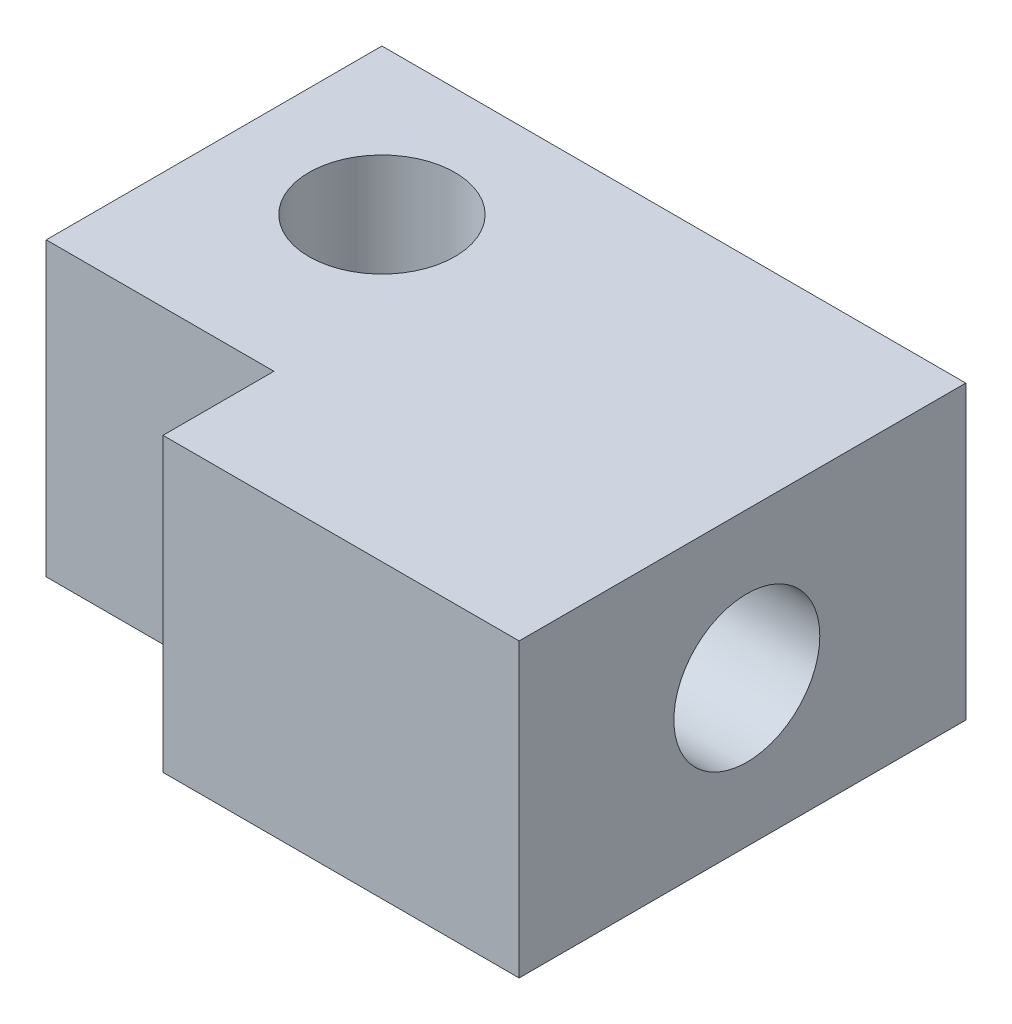
ISO-10303-21;
HEADER;
FILE_DESCRIPTION(('STEP AP214'),'2;1');
FILE_NAME('part.step','',(''),(''),'','','');
FILE_SCHEMA(('AUTOMOTIVE_DESIGN { 1 0 10303 214 1 1 1 1 }'));
ENDSEC;
DATA;
#1=APPLICATION_CONTEXT('core data for automotive mechanical design processes');
#2=APPLICATION_PROTOCOL_DEFINITION('international standard','automotive_design',2000,#1);
#3=PRODUCT_CONTEXT('',#1,'mechanical');
#4=PRODUCT('Part','Part','',(#3));
#5=PRODUCT_RELATED_PRODUCT_CATEGORY('part','',(#4));
#6=PRODUCT_DEFINITION_FORMATION('','',#4);
#7=PRODUCT_DEFINITION_CONTEXT('part definition',#1,'design');
#8=PRODUCT_DEFINITION('design','',#6,#7);
#9=PRODUCT_DEFINITION_SHAPE('','',#8);
#10=(LENGTH_UNIT() NAMED_UNIT(*) SI_UNIT(.MILLI.,.METRE.));
#11=(NAMED_UNIT(*) PLANE_ANGLE_UNIT() SI_UNIT($,.RADIAN.));
#12=(NAMED_UNIT(*) SI_UNIT($,.STERADIAN.) SOLID_ANGLE_UNIT());
#13=UNCERTAINTY_MEASURE_WITH_UNIT(LENGTH_MEASURE(1.E-05),#10,'distance_accuracy_value','');
#14=(GEOMETRIC_REPRESENTATION_CONTEXT(3) GLOBAL_UNCERTAINTY_ASSIGNED_CONTEXT((#13)) GLOBAL_UNIT_ASSIGNED_CONTEXT((#10,
#11,#12)) REPRESENTATION_CONTEXT('',''));
#15=CARTESIAN_POINT('',(0.,0.,0.));
#16=DIRECTION('',(0.,0.,1.));
#17=DIRECTION('',(1.,0.,0.));
#18=AXIS2_PLACEMENT_3D('',#15,#16,#17);
#19=CARTESIAN_POINT('',(79.,5.,0.));
#20=DIRECTION('',(1.,0.,0.));
#21=DIRECTION('',(0.,0.,-1.));
#22=AXIS2_PLACEMENT_3D('',#19,#20,#21);
#23=PLANE('',#22);
#24=CARTESIAN_POINT('',(79.,2.5,6.24999999999997));
#25=DIRECTION('',(1.,0.,0.));
#26=DIRECTION('',(0.,0.,-1.));
#27=AXIS2_PLACEMENT_3D('',#24,#25,#26);
#28=CIRCLE('',#27,1.25);
#29=CARTESIAN_POINT('',(79.,2.5,4.99999999999997));
#30=VERTEX_POINT('',#29);
#31=EDGE_CURVE('E184',#30,#30,#28,.T.);
#32=ORIENTED_EDGE('',*,*,#31,.T.);
#33=EDGE_LOOP('',(#32));
#34=FACE_BOUND('',#33,.T.);
#35=DIRECTION('',(0.,0.,1.));
#36=VECTOR('',#35,1.);
#37=CARTESIAN_POINT('',(79.,0.,0.));
#38=LINE('',#37,#36);
#39=CARTESIAN_POINT('',(79.,0.,2.49999999999997));
#40=VERTEX_POINT('',#39);
#41=CARTESIAN_POINT('',(79.,0.,8.24999999999999));
#42=VERTEX_POINT('',#41);
#43=EDGE_CURVE('E128',#40,#42,#38,.T.);
#44=ORIENTED_EDGE('',*,*,#43,.T.);
#45=DIRECTION('',(0.,-1.,0.));
#46=VECTOR('',#45,1.);
#47=CARTESIAN_POINT('',(79.,5.,8.24999999999999));
#48=LINE('',#47,#46);
#49=CARTESIAN_POINT('',(79.,5.,8.24999999999999));
#50=VERTEX_POINT('',#49);
#51=EDGE_CURVE('E11',#50,#42,#48,.T.);
#52=ORIENTED_EDGE('',*,*,#51,.F.);
#53=DIRECTION('',(0.,0.,1.));
#54=VECTOR('',#53,1.);
#55=CARTESIAN_POINT('',(79.,5.,0.));
#56=LINE('',#55,#54);
#57=CARTESIAN_POINT('',(79.,5.,2.49999999999997));
#58=VERTEX_POINT('',#57);
#59=EDGE_CURVE('E190',#58,#50,#56,.T.);
#60=ORIENTED_EDGE('',*,*,#59,.F.);
#61=DIRECTION('',(0.,-1.,0.));
#62=VECTOR('',#61,1.);
#63=CARTESIAN_POINT('',(79.,5.,2.49999999999997));
#64=LINE('',#63,#62);
#65=EDGE_CURVE('E57',#58,#40,#64,.T.);
#66=ORIENTED_EDGE('',*,*,#65,.T.);
#67=EDGE_LOOP('',(#44,#52,#60,#66));
#68=FACE_BOUND('',#67,.T.);
#69=ADVANCED_FACE('F34',(#34,#68),#23,.F.);
#70=CARTESIAN_POINT('',(0.,5.,8.24999999999999));
#71=DIRECTION('',(0.,0.,-1.));
#72=DIRECTION('',(-1.,0.,0.));
#73=AXIS2_PLACEMENT_3D('',#70,#71,#72);
#74=PLANE('',#73);
#75=DIRECTION('',(1.,0.,0.));
#76=VECTOR('',#75,1.);
#77=CARTESIAN_POINT('',(0.,0.,8.24999999999999));
#78=LINE('',#77,#76);
#79=CARTESIAN_POINT('',(82.9,0.,8.24999999999999));
#80=VERTEX_POINT('',#79);
#81=EDGE_CURVE('E130',#42,#80,#78,.T.);
#82=ORIENTED_EDGE('',*,*,#81,.T.);
#83=DIRECTION('',(0.,-1.,0.));
#84=VECTOR('',#83,1.);
#85=CARTESIAN_POINT('',(82.9,5.,8.24999999999999));
#86=LINE('',#85,#84);
#87=CARTESIAN_POINT('',(82.9,5.,8.24999999999999));
#88=VERTEX_POINT('',#87);
#89=EDGE_CURVE('E49',#88,#80,#86,.T.);
#90=ORIENTED_EDGE('',*,*,#89,.F.);
#91=DIRECTION('',(1.,0.,0.));
#92=VECTOR('',#91,1.);
#93=CARTESIAN_POINT('',(0.,5.,8.24999999999999));
#94=LINE('',#93,#92);
#95=EDGE_CURVE('E89',#50,#88,#94,.T.);
#96=ORIENTED_EDGE('',*,*,#95,.F.);
#97=ORIENTED_EDGE('',*,*,#51,.T.);
#98=EDGE_LOOP('',(#82,#90,#96,#97));
#99=FACE_BOUND('',#98,.T.);
#100=ADVANCED_FACE('F149',(#99),#74,.F.);
#101=CARTESIAN_POINT('',(82.9,5.,0.));
#102=DIRECTION('',(-1.,0.,0.));
#103=DIRECTION('',(0.,0.,1.));
#104=AXIS2_PLACEMENT_3D('',#101,#102,#103);
#105=PLANE('',#104);
#106=DIRECTION('',(0.,0.,-1.));
#107=VECTOR('',#106,1.);
#108=CARTESIAN_POINT('',(82.9,0.,0.));
#109=LINE('',#108,#107);
#110=CARTESIAN_POINT('',(82.9,0.,10.15));
#111=VERTEX_POINT('',#110);
#112=EDGE_CURVE('E133',#111,#80,#109,.T.);
#113=ORIENTED_EDGE('',*,*,#112,.F.);
#114=DIRECTION('',(0.,-1.,0.));
#115=VECTOR('',#114,1.);
#116=CARTESIAN_POINT('',(82.9,5.,10.15));
#117=LINE('',#116,#115);
#118=CARTESIAN_POINT('',(82.9,5.,10.15));
#119=VERTEX_POINT('',#118);
#120=EDGE_CURVE('E117',#119,#111,#117,.T.);
#121=ORIENTED_EDGE('',*,*,#120,.F.);
#122=DIRECTION('',(0.,0.,-1.));
#123=VECTOR('',#122,1.);
#124=CARTESIAN_POINT('',(82.9,5.,0.));
#125=LINE('',#124,#123);
#126=EDGE_CURVE('E107',#119,#88,#125,.T.);
#127=ORIENTED_EDGE('',*,*,#126,.T.);
#128=ORIENTED_EDGE('',*,*,#89,.T.);
#129=EDGE_LOOP('',(#113,#121,#127,#128));
#130=FACE_BOUND('',#129,.T.);
#131=ADVANCED_FACE('F148',(#130),#105,.T.);
#132=CARTESIAN_POINT('',(0.,5.,10.15));
#133=DIRECTION('',(0.,0.,-1.));
#134=DIRECTION('',(-1.,0.,0.));
#135=AXIS2_PLACEMENT_3D('',#132,#133,#134);
#136=PLANE('',#135);
#137=DIRECTION('',(1.,0.,0.));
#138=VECTOR('',#137,1.);
#139=CARTESIAN_POINT('',(0.,0.,10.15));
#140=LINE('',#139,#138);
#141=CARTESIAN_POINT('',(89.,0.,10.15));
#142=VERTEX_POINT('',#141);
#143=EDGE_CURVE('E114',#111,#142,#140,.T.);
#144=ORIENTED_EDGE('',*,*,#143,.T.);
#145=DIRECTION('',(0.,-1.,0.));
#146=VECTOR('',#145,1.);
#147=CARTESIAN_POINT('',(89.,5.,10.15));
#148=LINE('',#147,#146);
#149=CARTESIAN_POINT('',(89.,5.,10.15));
#150=VERTEX_POINT('',#149);
#151=EDGE_CURVE('E111',#150,#142,#148,.T.);
#152=ORIENTED_EDGE('',*,*,#151,.F.);
#153=DIRECTION('',(1.,0.,0.));
#154=VECTOR('',#153,1.);
#155=CARTESIAN_POINT('',(0.,5.,10.15));
#156=LINE('',#155,#154);
#157=EDGE_CURVE('E100',#119,#150,#156,.T.);
#158=ORIENTED_EDGE('',*,*,#157,.F.);
#159=ORIENTED_EDGE('',*,*,#120,.T.);
#160=EDGE_LOOP('',(#144,#152,#158,#159));
#161=FACE_BOUND('',#160,.T.);
#162=ADVANCED_FACE('F112',(#161),#136,.F.);
#163=CARTESIAN_POINT('',(89.,5.,0.));
#164=DIRECTION('',(1.,0.,0.));
#165=DIRECTION('',(0.,0.,-1.));
#166=AXIS2_PLACEMENT_3D('',#163,#164,#165);
#167=PLANE('',#166);
#168=CARTESIAN_POINT('',(89.,2.5,6.24999999999997));
#169=DIRECTION('',(1.,0.,0.));
#170=DIRECTION('',(0.,0.,-1.));
#171=AXIS2_PLACEMENT_3D('',#168,#169,#170);
#172=CIRCLE('',#171,1.25);
#173=CARTESIAN_POINT('',(89.,2.5,4.99999999999997));
#174=VERTEX_POINT('',#173);
#175=EDGE_CURVE('E182',#174,#174,#172,.T.);
#176=ORIENTED_EDGE('',*,*,#175,.F.);
#177=EDGE_LOOP('',(#176));
#178=FACE_BOUND('',#177,.T.);
#179=DIRECTION('',(0.,0.,1.));
#180=VECTOR('',#179,1.);
#181=CARTESIAN_POINT('',(89.,0.,0.));
#182=LINE('',#181,#180);
#183=CARTESIAN_POINT('',(89.,0.,2.49999999999997));
#184=VERTEX_POINT('',#183);
#185=EDGE_CURVE('E137',#184,#142,#182,.T.);
#186=ORIENTED_EDGE('',*,*,#185,.F.);
#187=DIRECTION('',(0.,-1.,0.));
#188=VECTOR('',#187,1.);
#189=CARTESIAN_POINT('',(89.,5.,2.49999999999997));
#190=LINE('',#189,#188);
#191=CARTESIAN_POINT('',(89.,5.,2.49999999999997));
#192=VERTEX_POINT('',#191);
#193=EDGE_CURVE('E77',#192,#184,#190,.T.);
#194=ORIENTED_EDGE('',*,*,#193,.F.);
#195=DIRECTION('',(0.,0.,1.));
#196=VECTOR('',#195,1.);
#197=CARTESIAN_POINT('',(89.,5.,0.));
#198=LINE('',#197,#196);
#199=EDGE_CURVE('E105',#192,#150,#198,.T.);
#200=ORIENTED_EDGE('',*,*,#199,.T.);
#201=ORIENTED_EDGE('',*,*,#151,.T.);
#202=EDGE_LOOP('',(#186,#194,#200,#201));
#203=FACE_BOUND('',#202,.T.);
#204=ADVANCED_FACE('F119',(#178,#203),#167,.T.);
#205=CARTESIAN_POINT('',(81.5,5.,5.));
#206=DIRECTION('',(0.,-1.,0.));
#207=DIRECTION('',(0.,0.,-1.));
#208=AXIS2_PLACEMENT_3D('',#205,#206,#207);
#209=CYLINDRICAL_SURFACE('',#208,1.25);
#210=CARTESIAN_POINT('',(80.25,2.5,4.99999999999997));
#211=CARTESIAN_POINT('',(80.2499966441939,2.56961208202377,5.00000213470243));
#212=CARTESIAN_POINT('',(80.2499582988169,2.63924791062334,5.00583137700037));
#213=CARTESIAN_POINT('',(80.2502843717335,2.77662237854133,5.0290008984842));
#214=CARTESIAN_POINT('',(80.2506491083581,2.84435947500368,5.04635027128573));
#215=CARTESIAN_POINT('',(80.2531877682139,2.97606907888645,5.09210426216157));
#216=CARTESIAN_POINT('',(80.2553639583087,3.04003676178567,5.12052270841945));
#217=CARTESIAN_POINT('',(80.2636853395395,3.16215940293159,5.18750913779315));
#218=CARTESIAN_POINT('',(80.2698290795568,3.2203164774131,5.22607340705217));
#219=CARTESIAN_POINT('',(80.2883337207344,3.32668681324461,5.31005580178865));
#220=CARTESIAN_POINT('',(80.3004411549752,3.37520075741395,5.35514553441002));
#221=CARTESIAN_POINT('',(80.3330033337281,3.4632495864012,5.45071740351099));
#222=CARTESIAN_POINT('',(80.3534443376478,3.50279908578408,5.50119056299411));
#223=CARTESIAN_POINT('',(80.4006584215015,3.56721932561987,5.59699246732916));
#224=CARTESIAN_POINT('',(80.4261912733856,3.5933551955091,5.64208658692434));
#225=CARTESIAN_POINT('',(80.4846953353207,3.63829483438518,5.73108683186754));
#226=CARTESIAN_POINT('',(80.5176667460866,3.6570984054871,5.77499292512322));
#227=CARTESIAN_POINT('',(80.5883287029856,3.68730487831171,5.8568025573928));
#228=CARTESIAN_POINT('',(80.6256353069815,3.69907334581835,5.89490647139188));
#229=CARTESIAN_POINT('',(80.7054728944305,3.71798823476215,5.96649089793395));
#230=CARTESIAN_POINT('',(80.748005582285,3.72513314351534,5.99996989453367));
#231=CARTESIAN_POINT('',(80.8417661902864,3.73660714807492,6.06431813490495));
#232=CARTESIAN_POINT('',(80.8934380713187,3.74058751648074,6.09460102816854));
#233=CARTESIAN_POINT('',(81.0006895768752,3.74607520609984,6.1475065401068));
#234=CARTESIAN_POINT('',(81.0562713048303,3.74758118535783,6.17012499679175));
#235=CARTESIAN_POINT('',(81.1772527978942,3.74951998206867,6.20949049954831));
#236=CARTESIAN_POINT('',(81.2430113293509,3.74979511490995,6.2251501386427));
#237=CARTESIAN_POINT('',(81.376191775167,3.75003468571998,6.24567841175893));
#238=CARTESIAN_POINT('',(81.4436139719799,3.74999907056363,6.25054520046926));
#239=CARTESIAN_POINT('',(81.5811605820418,3.75000096595674,6.24933355657024));
#240=CARTESIAN_POINT('',(81.6512814610072,3.75004156090999,6.24279425347822));
#241=CARTESIAN_POINT('',(81.7894585600108,3.74965176666125,6.2180487393185));
#242=CARTESIAN_POINT('',(81.8575139843125,3.74922119824797,6.1998380900396));
#243=CARTESIAN_POINT('',(81.989648093395,3.7463993537575,6.15224958180106));
#244=CARTESIAN_POINT('',(82.0537230174764,3.74400625293701,6.12286134367093));
#245=CARTESIAN_POINT('',(82.1758267664104,3.73500655620218,6.05388102424775));
#246=CARTESIAN_POINT('',(82.233857988606,3.72840163844329,6.01429301069332));
#247=CARTESIAN_POINT('',(82.3391241034773,3.70878882707751,5.9288332669613));
#248=CARTESIAN_POINT('',(82.3867536693946,3.69611750236942,5.88337455897488));
#249=CARTESIAN_POINT('',(82.4729905664969,3.66233911820245,5.78735924012225));
#250=CARTESIAN_POINT('',(82.5116126032548,3.64124596301134,5.73681113410658));
#251=CARTESIAN_POINT('',(82.5743051627702,3.59287212678173,5.64123603257127));
#252=CARTESIAN_POINT('',(82.5996459406913,3.56683986489073,5.59640475030392));
#253=CARTESIAN_POINT('',(82.6431233587973,3.50744619431329,5.50812495478607));
#254=CARTESIAN_POINT('',(82.6612594338449,3.47408421100177,5.46467655025436));
#255=CARTESIAN_POINT('',(82.6904318695824,3.40255553597077,5.38358776850986));
#256=CARTESIAN_POINT('',(82.7017839204193,3.36472187446476,5.34576398844717));
#257=CARTESIAN_POINT('',(82.7199571995565,3.28389364826441,5.27485662987009));
#258=CARTESIAN_POINT('',(82.7267769247775,3.24089737704215,5.24177462674631));
#259=CARTESIAN_POINT('',(82.737694336363,3.14603902502818,5.17821603954547));
#260=CARTESIAN_POINT('',(82.7414378069539,3.09371991582407,5.14836219617345));
#261=CARTESIAN_POINT('',(82.7465463772122,2.98523492280653,5.09645345163569));
#262=CARTESIAN_POINT('',(82.7479101932335,2.92906697980044,5.0744027647997));
#263=CARTESIAN_POINT('',(82.7496336023165,2.80705364865029,5.03641741445868));
#264=CARTESIAN_POINT('',(82.7498493852892,2.74086664457983,5.02156567694403));
#265=CARTESIAN_POINT('',(82.7500323660684,2.60696297395126,5.00274965867395));
#266=CARTESIAN_POINT('',(82.7499995240018,2.53924606377112,4.99878712441067));
#267=CARTESIAN_POINT('',(82.7500004098209,2.40147614991495,5.00191445105173));
#268=CARTESIAN_POINT('',(82.7500367201959,2.33143237833465,5.00943091372374));
#269=CARTESIAN_POINT('',(82.7495484870311,2.19357200827068,5.0361080113089));
#270=CARTESIAN_POINT('',(82.7490237224534,2.12575629839368,5.05527323401737));
#271=CARTESIAN_POINT('',(82.7458525226247,1.9943058623263,5.1047033903235));
#272=CARTESIAN_POINT('',(82.7432053890272,1.93067251976414,5.13497197560407));
#273=CARTESIAN_POINT('',(82.7334884409398,1.80962095698284,5.20559766315693));
#274=CARTESIAN_POINT('',(82.7264207826052,1.75219972275228,5.24594984129698));
#275=CARTESIAN_POINT('',(82.705735679294,1.64851353614718,5.33251524428974));
#276=CARTESIAN_POINT('',(82.6924946782374,1.60181213616054,5.37829130408487));
#277=CARTESIAN_POINT('',(82.6575078619976,1.51745459286228,5.47463783834487));
#278=CARTESIAN_POINT('',(82.635775701913,1.47978408264609,5.52520051675604));
#279=CARTESIAN_POINT('',(82.5862697158515,1.41881728867979,5.62047684851794));
#280=CARTESIAN_POINT('',(82.5597434423622,1.39425478023546,5.66503479521486));
#281=CARTESIAN_POINT('',(82.4994721642957,1.35220538364914,5.75257978021854));
#282=CARTESIAN_POINT('',(82.4657263004416,1.33471933846601,5.7955666308195));
#283=CARTESIAN_POINT('',(82.3933308552125,1.30655416146121,5.87593329878583));
#284=CARTESIAN_POINT('',(82.3549639204367,1.29560834217331,5.91347696046456));
#285=CARTESIAN_POINT('',(82.2731307199545,1.27815731196305,5.98370722779334));
#286=CARTESIAN_POINT('',(82.2296627322469,1.27165360568087,6.01639218476457));
#287=CARTESIAN_POINT('',(82.1336964622539,1.26127870865885,6.07914731221652));
#288=CARTESIAN_POINT('',(82.0807297392109,1.25776553020135,6.10855901629996));
#289=CARTESIAN_POINT('',(81.9710124197803,1.2530222492878,6.1594441664789));
#290=CARTESIAN_POINT('',(81.9142598176934,1.25179336712783,6.18091336469875));
#291=CARTESIAN_POINT('',(81.7912352333268,1.25027082498097,6.21748796411294));
#292=CARTESIAN_POINT('',(81.7246392933944,1.25010742545669,6.23151738913182));
#293=CARTESIAN_POINT('',(81.5900544673267,1.24997166115095,6.24859709166548));
#294=CARTESIAN_POINT('',(81.5220653713908,1.24999932535647,6.25164570313469));
#295=CARTESIAN_POINT('',(81.3841127188679,1.25000126798475,6.24659426381383));
#296=CARTESIAN_POINT('',(81.3141631766934,1.24997364732106,6.23810095400323));
#297=CARTESIAN_POINT('',(81.1766536714315,1.25057562156408,6.20949634110973));
#298=CARTESIAN_POINT('',(81.1090946902133,1.25120548335054,6.18938032171482));
#299=CARTESIAN_POINT('',(80.978363489174,1.25475270067905,6.13812207935667));
#300=CARTESIAN_POINT('',(80.9151899509904,1.25766936548677,6.10698318743605));
#301=CARTESIAN_POINT('',(80.7952265440859,1.26813640286798,6.03473910931332));
#302=CARTESIAN_POINT('',(80.7384329937601,1.2756840866685,5.99363971455747));
#303=CARTESIAN_POINT('',(80.6363586714732,1.29746563865863,5.90602201906767));
#304=CARTESIAN_POINT('',(80.590597696782,1.31128087138781,5.85996362609099));
#305=CARTESIAN_POINT('',(80.5081326578494,1.34747256917294,5.76335820818407));
#306=CARTESIAN_POINT('',(80.4714147013236,1.36983576585733,5.71281823259493));
#307=CARTESIAN_POINT('',(80.412150780466,1.42045690597151,5.61788443840036));
#308=CARTESIAN_POINT('',(80.3883475519103,1.44747313546941,5.573606457071));
#309=CARTESIAN_POINT('',(80.3476891292491,1.50861355597866,5.4868038839195));
#310=CARTESIAN_POINT('',(80.330834857985,1.54273869016781,5.444279525658));
#311=CARTESIAN_POINT('',(80.3036508482643,1.61600174373601,5.36463589719977));
#312=CARTESIAN_POINT('',(80.2931018625135,1.65490616678284,5.32737446492237));
#313=CARTESIAN_POINT('',(80.2763538905153,1.73775856825301,5.25782179864974));
#314=CARTESIAN_POINT('',(80.2701568362694,1.78170877664738,5.22553277707198));
#315=CARTESIAN_POINT('',(80.2603094051362,1.87880464063751,5.16358763163124));
#316=CARTESIAN_POINT('',(80.2570199327147,1.93242920298578,5.13462626731255));
#317=CARTESIAN_POINT('',(80.2526278426769,2.04338243790745,5.0847952522022));
#318=CARTESIAN_POINT('',(80.251525423763,2.10071144655582,5.06392633677986));
#319=CARTESIAN_POINT('',(80.2503024539309,2.21459251779245,5.03166055410008));
#320=CARTESIAN_POINT('',(80.2501314958463,2.27101556157452,5.01980802815046));
#321=CARTESIAN_POINT('',(80.2499816479542,2.38495360603711,5.00397655580462));
#322=CARTESIAN_POINT('',(80.2500027734253,2.44246869321696,4.99999823576281));
#323=CARTESIAN_POINT('',(80.25,2.5,4.99999999999997));
#324=B_SPLINE_CURVE_WITH_KNOTS('',3,(#210,#211,#212,#213,#214,#215,#216,#217,#218,#219,#220,
#221,#222,#223,#224,#225,#226,#227,#228,#229,#230,#231,#232,#233,#234,#235,#236,#237,#238,#239,
#240,#241,#242,#243,#244,#245,#246,#247,#248,#249,#250,#251,#252,#253,#254,#255,#256,#257,#258,
#259,#260,#261,#262,#263,#264,#265,#266,#267,#268,#269,#270,#271,#272,#273,#274,#275,#276,#277,
#278,#279,#280,#281,#282,#283,#284,#285,#286,#287,#288,#289,#290,#291,#292,#293,#294,#295,#296,
#297,#298,#299,#300,#301,#302,#303,#304,#305,#306,#307,#308,#309,#310,#311,#312,#313,#314,#315,
#316,#317,#318,#319,#320,#321,#322,#323),.UNSPECIFIED.,.T.,.F.,(4,2,2,2,2,2,2,2,2,2,2,2,2,2,2,2,
2,2,2,2,2,2,2,2,2,2,2,2,2,2,2,2,2,2,2,2,2,2,2,2,2,2,2,2,2,2,2,2,2,2,2,2,2,2,2,2,4),(0.,
0.208635853058989,0.417436592556166,0.626499020055714,0.835485026919865,1.03626900279049,
1.23672325150912,1.40989905564518,1.58307953314629,1.74622940236774,1.9094326221783,
2.08879044033089,2.26824549897724,2.47013348722586,2.67205599068609,2.88232735327896,
3.0926787223127,3.30322589602162,3.51368923173191,3.71363214752705,3.91324631771992,
4.08543282663773,4.25763283920861,4.42102516331618,4.58447164708461,4.76481230506924,
4.94525021334123,5.14783584231474,5.35045396159618,5.56078743163861,5.77120379400175,
5.98168942040357,6.19207246030314,6.3910330931287,6.58967507471363,6.76090552970108,
6.93215637591609,7.09583847723662,7.2595759937824,7.44090954126658,7.62233993130793,
7.82559178979602,8.02887448503356,8.23925993141412,8.44973080890384,8.66013813764087,
8.87042341917873,9.06836080425883,9.2659921853564,9.43631189364917,9.6066542136102,
9.77066437891944,9.93474730914127,10.1171215855154,10.2995124305504,10.4719270207556,
10.6443553251436),.UNSPECIFIED.);
#325=CARTESIAN_POINT('',(80.25,2.5,4.99999999999997));
#326=VERTEX_POINT('',#325);
#327=EDGE_CURVE('E39',#326,#326,#324,.T.);
#328=ORIENTED_EDGE('',*,*,#327,.F.);
#329=EDGE_LOOP('',(#328));
#330=FACE_BOUND('',#329,.T.);
#331=CARTESIAN_POINT('',(81.5,5.,5.));
#332=DIRECTION('',(0.,1.,0.));
#333=DIRECTION('',(0.,0.,1.));
#334=AXIS2_PLACEMENT_3D('',#331,#332,#333);
#335=CIRCLE('',#334,1.25);
#336=CARTESIAN_POINT('',(81.5,5.,6.25));
#337=VERTEX_POINT('',#336);
#338=EDGE_CURVE('E142',#337,#337,#335,.T.);
#339=ORIENTED_EDGE('',*,*,#338,.T.);
#340=EDGE_LOOP('',(#339));
#341=FACE_BOUND('',#340,.T.);
#342=CARTESIAN_POINT('',(81.5,0.,5.));
#343=DIRECTION('',(0.,1.,0.));
#344=DIRECTION('',(0.,0.,1.));
#345=AXIS2_PLACEMENT_3D('',#342,#343,#344);
#346=CIRCLE('',#345,1.25);
#347=CARTESIAN_POINT('',(81.5,0.,6.25));
#348=VERTEX_POINT('',#347);
#349=EDGE_CURVE('E125',#348,#348,#346,.T.);
#350=ORIENTED_EDGE('',*,*,#349,.F.);
#351=EDGE_LOOP('',(#350));
#352=FACE_BOUND('',#351,.T.);
#353=ADVANCED_FACE('F36',(#330,#341,#352),#209,.F.);
#354=CARTESIAN_POINT('',(0.,5.,2.49999999999997));
#355=DIRECTION('',(0.,0.,-1.));
#356=DIRECTION('',(-1.,0.,0.));
#357=AXIS2_PLACEMENT_3D('',#354,#355,#356);
#358=PLANE('',#357);
#359=DIRECTION('',(1.,0.,0.));
#360=VECTOR('',#359,1.);
#361=CARTESIAN_POINT('',(0.,0.,2.49999999999997));
#362=LINE('',#361,#360);
#363=EDGE_CURVE('E139',#40,#184,#362,.T.);
#364=ORIENTED_EDGE('',*,*,#363,.F.);
#365=ORIENTED_EDGE('',*,*,#65,.F.);
#366=DIRECTION('',(1.,0.,0.));
#367=VECTOR('',#366,1.);
#368=CARTESIAN_POINT('',(0.,5.,2.49999999999997));
#369=LINE('',#368,#367);
#370=EDGE_CURVE('E120',#58,#192,#369,.T.);
#371=ORIENTED_EDGE('',*,*,#370,.T.);
#372=ORIENTED_EDGE('',*,*,#193,.T.);
#373=EDGE_LOOP('',(#364,#365,#371,#372));
#374=FACE_BOUND('',#373,.T.);
#375=ADVANCED_FACE('F153',(#374),#358,.T.);
#376=CARTESIAN_POINT('',(0.,5.,0.));
#377=DIRECTION('',(0.,1.,0.));
#378=DIRECTION('',(0.,0.,1.));
#379=AXIS2_PLACEMENT_3D('',#376,#377,#378);
#380=PLANE('',#379);
#381=ORIENTED_EDGE('',*,*,#338,.F.);
#382=EDGE_LOOP('',(#381));
#383=FACE_BOUND('',#382,.T.);
#384=ORIENTED_EDGE('',*,*,#59,.T.);
#385=ORIENTED_EDGE('',*,*,#95,.T.);
#386=ORIENTED_EDGE('',*,*,#126,.F.);
#387=ORIENTED_EDGE('',*,*,#157,.T.);
#388=ORIENTED_EDGE('',*,*,#199,.F.);
#389=ORIENTED_EDGE('',*,*,#370,.F.);
#390=EDGE_LOOP('',(#384,#385,#386,#387,#388,#389));
#391=FACE_BOUND('',#390,.T.);
#392=ADVANCED_FACE('F102',(#383,#391),#380,.T.);
#393=CARTESIAN_POINT('',(0.,0.,0.));
#394=DIRECTION('',(0.,1.,0.));
#395=DIRECTION('',(0.,0.,1.));
#396=AXIS2_PLACEMENT_3D('',#393,#394,#395);
#397=PLANE('',#396);
#398=ORIENTED_EDGE('',*,*,#349,.T.);
#399=EDGE_LOOP('',(#398));
#400=FACE_BOUND('',#399,.T.);
#401=ORIENTED_EDGE('',*,*,#43,.F.);
#402=ORIENTED_EDGE('',*,*,#363,.T.);
#403=ORIENTED_EDGE('',*,*,#185,.T.);
#404=ORIENTED_EDGE('',*,*,#143,.F.);
#405=ORIENTED_EDGE('',*,*,#112,.T.);
#406=ORIENTED_EDGE('',*,*,#81,.F.);
#407=EDGE_LOOP('',(#401,#402,#403,#404,#405,#406));
#408=FACE_BOUND('',#407,.T.);
#409=ADVANCED_FACE('F152',(#400,#408),#397,.F.);
#410=CARTESIAN_POINT('',(79.,2.5,6.24999999999997));
#411=DIRECTION('',(1.,0.,0.));
#412=DIRECTION('',(0.,0.,-1.));
#413=AXIS2_PLACEMENT_3D('',#410,#411,#412);
#414=CYLINDRICAL_SURFACE('',#413,1.25);
#415=ORIENTED_EDGE('',*,*,#327,.T.);
#416=EDGE_LOOP('',(#415));
#417=FACE_BOUND('',#416,.T.);
#418=ORIENTED_EDGE('',*,*,#31,.F.);
#419=EDGE_LOOP('',(#418));
#420=FACE_BOUND('',#419,.T.);
#421=ORIENTED_EDGE('',*,*,#175,.T.);
#422=EDGE_LOOP('',(#421));
#423=FACE_BOUND('',#422,.T.);
#424=ADVANCED_FACE('F198',(#417,#420,#423),#414,.F.);
#425=CLOSED_SHELL('',(#69,#100,#131,#162,#204,#353,#375,#392,#409,#424));
#426=MANIFOLD_SOLID_BREP('B2',#425);
#427=ADVANCED_BREP_SHAPE_REPRESENTATION('',(#18,#426),#14);
#428=SHAPE_DEFINITION_REPRESENTATION(#9,#427);
ENDSEC;
END-ISO-10303-21;
